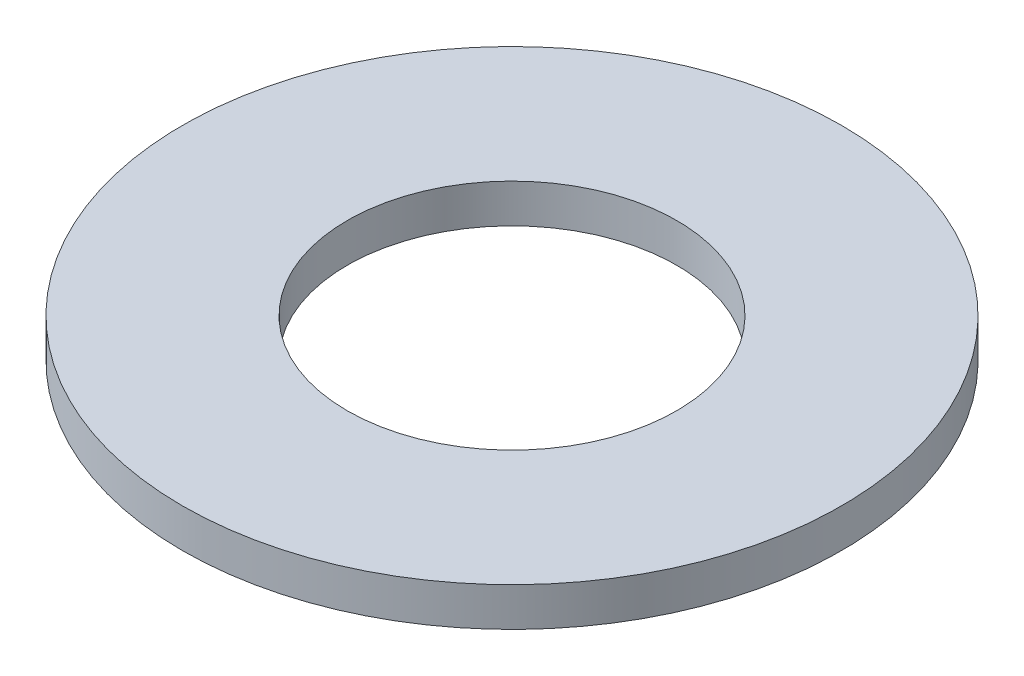
ISO-10303-21;
HEADER;
FILE_DESCRIPTION(('STEP AP214'),'2;1');
FILE_NAME('part.step','',(''),(''),'','','');
FILE_SCHEMA(('AUTOMOTIVE_DESIGN { 1 0 10303 214 1 1 1 1 }'));
ENDSEC;
DATA;
#1=APPLICATION_CONTEXT('core data for automotive mechanical design processes');
#2=APPLICATION_PROTOCOL_DEFINITION('international standard','automotive_design',2000,#1);
#3=PRODUCT_CONTEXT('',#1,'mechanical');
#4=PRODUCT('Part','Part','',(#3));
#5=PRODUCT_RELATED_PRODUCT_CATEGORY('part','',(#4));
#6=PRODUCT_DEFINITION_FORMATION('','',#4);
#7=PRODUCT_DEFINITION_CONTEXT('part definition',#1,'design');
#8=PRODUCT_DEFINITION('design','',#6,#7);
#9=PRODUCT_DEFINITION_SHAPE('','',#8);
#10=(LENGTH_UNIT() NAMED_UNIT(*) SI_UNIT(.MILLI.,.METRE.));
#11=(NAMED_UNIT(*) PLANE_ANGLE_UNIT() SI_UNIT($,.RADIAN.));
#12=(NAMED_UNIT(*) SI_UNIT($,.STERADIAN.) SOLID_ANGLE_UNIT());
#13=UNCERTAINTY_MEASURE_WITH_UNIT(LENGTH_MEASURE(1.E-05),#10,'distance_accuracy_value','');
#14=(GEOMETRIC_REPRESENTATION_CONTEXT(3) GLOBAL_UNCERTAINTY_ASSIGNED_CONTEXT((#13)) GLOBAL_UNIT_ASSIGNED_CONTEXT((#10,
#11,#12)) REPRESENTATION_CONTEXT('',''));
#15=CARTESIAN_POINT('',(0.,0.,0.));
#16=DIRECTION('',(0.,0.,1.));
#17=DIRECTION('',(1.,0.,0.));
#18=AXIS2_PLACEMENT_3D('',#15,#16,#17);
#19=CARTESIAN_POINT('',(0.,10.,0.));
#20=DIRECTION('',(0.,-1.,0.));
#21=DIRECTION('',(0.,0.,-1.));
#22=AXIS2_PLACEMENT_3D('',#19,#20,#21);
#23=CYLINDRICAL_SURFACE('',#22,85.);
#24=CARTESIAN_POINT('',(0.,10.,0.));
#25=DIRECTION('',(0.,1.,0.));
#26=DIRECTION('',(0.,0.,1.));
#27=AXIS2_PLACEMENT_3D('',#24,#25,#26);
#28=CIRCLE('',#27,85.);
#29=CARTESIAN_POINT('',(0.,10.,85.));
#30=VERTEX_POINT('',#29);
#31=EDGE_CURVE('E10',#30,#30,#28,.T.);
#32=ORIENTED_EDGE('',*,*,#31,.F.);
#33=EDGE_LOOP('',(#32));
#34=FACE_BOUND('',#33,.T.);
#35=CARTESIAN_POINT('',(0.,0.,0.));
#36=DIRECTION('',(0.,1.,0.));
#37=DIRECTION('',(0.,0.,1.));
#38=AXIS2_PLACEMENT_3D('',#35,#36,#37);
#39=CIRCLE('',#38,85.);
#40=CARTESIAN_POINT('',(0.,0.,85.));
#41=VERTEX_POINT('',#40);
#42=EDGE_CURVE('E37',#41,#41,#39,.T.);
#43=ORIENTED_EDGE('',*,*,#42,.T.);
#44=EDGE_LOOP('',(#43));
#45=FACE_BOUND('',#44,.T.);
#46=ADVANCED_FACE('F40',(#34,#45),#23,.T.);
#47=CARTESIAN_POINT('',(0.,10.,0.));
#48=DIRECTION('',(0.,1.,0.));
#49=DIRECTION('',(0.,0.,1.));
#50=AXIS2_PLACEMENT_3D('',#47,#48,#49);
#51=PLANE('',#50);
#52=CARTESIAN_POINT('',(0.,10.,0.));
#53=DIRECTION('',(0.,1.,0.));
#54=DIRECTION('',(0.,0.,1.));
#55=AXIS2_PLACEMENT_3D('',#52,#53,#54);
#56=CIRCLE('',#55,42.5);
#57=CARTESIAN_POINT('',(0.,10.,42.5));
#58=VERTEX_POINT('',#57);
#59=EDGE_CURVE('E50',#58,#58,#56,.T.);
#60=ORIENTED_EDGE('',*,*,#59,.F.);
#61=EDGE_LOOP('',(#60));
#62=FACE_BOUND('',#61,.T.);
#63=ORIENTED_EDGE('',*,*,#31,.T.);
#64=EDGE_LOOP('',(#63));
#65=FACE_BOUND('',#64,.T.);
#66=ADVANCED_FACE('F59',(#62,#65),#51,.T.);
#67=CARTESIAN_POINT('',(0.,0.,0.));
#68=DIRECTION('',(0.,1.,0.));
#69=DIRECTION('',(0.,0.,1.));
#70=AXIS2_PLACEMENT_3D('',#67,#68,#69);
#71=PLANE('',#70);
#72=CARTESIAN_POINT('',(0.,0.,0.));
#73=DIRECTION('',(0.,1.,0.));
#74=DIRECTION('',(0.,0.,1.));
#75=AXIS2_PLACEMENT_3D('',#72,#73,#74);
#76=CIRCLE('',#75,42.5);
#77=CARTESIAN_POINT('',(0.,0.,42.5));
#78=VERTEX_POINT('',#77);
#79=EDGE_CURVE('E47',#78,#78,#76,.T.);
#80=ORIENTED_EDGE('',*,*,#79,.T.);
#81=EDGE_LOOP('',(#80));
#82=FACE_BOUND('',#81,.T.);
#83=ORIENTED_EDGE('',*,*,#42,.F.);
#84=EDGE_LOOP('',(#83));
#85=FACE_BOUND('',#84,.T.);
#86=ADVANCED_FACE('F58',(#82,#85),#71,.F.);
#87=CARTESIAN_POINT('',(0.,10.,0.));
#88=DIRECTION('',(0.,-1.,0.));
#89=DIRECTION('',(0.,0.,-1.));
#90=AXIS2_PLACEMENT_3D('',#87,#88,#89);
#91=CYLINDRICAL_SURFACE('',#90,42.5);
#92=ORIENTED_EDGE('',*,*,#59,.T.);
#93=EDGE_LOOP('',(#92));
#94=FACE_BOUND('',#93,.T.);
#95=ORIENTED_EDGE('',*,*,#79,.F.);
#96=EDGE_LOOP('',(#95));
#97=FACE_BOUND('',#96,.T.);
#98=ADVANCED_FACE('F54',(#94,#97),#91,.F.);
#99=CLOSED_SHELL('',(#46,#66,#86,#98));
#100=MANIFOLD_SOLID_BREP('B2',#99);
#101=ADVANCED_BREP_SHAPE_REPRESENTATION('',(#18,#100),#14);
#102=SHAPE_DEFINITION_REPRESENTATION(#9,#101);
ENDSEC;
END-ISO-10303-21;
